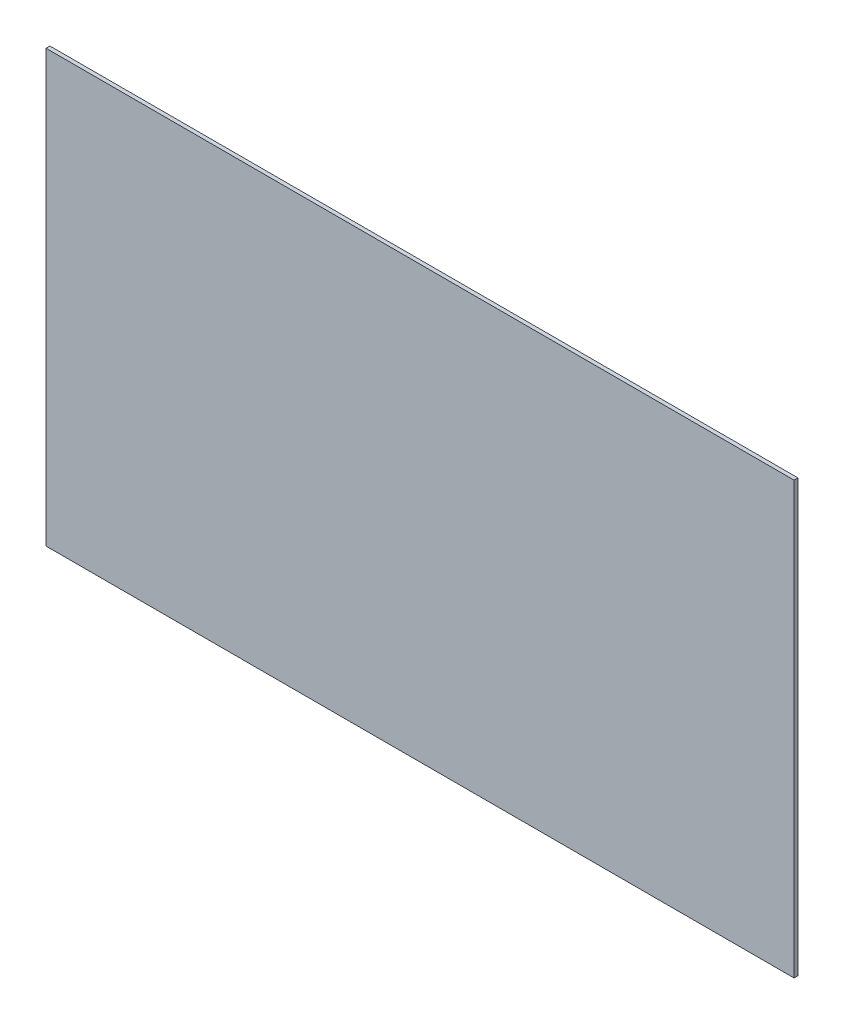
ISO-10303-21;
HEADER;
FILE_DESCRIPTION(('STEP AP214'),'2;1');
FILE_NAME('part.step','',(''),(''),'','','');
FILE_SCHEMA(('AUTOMOTIVE_DESIGN { 1 0 10303 214 1 1 1 1 }'));
ENDSEC;
DATA;
#1=APPLICATION_CONTEXT('core data for automotive mechanical design processes');
#2=APPLICATION_PROTOCOL_DEFINITION('international standard','automotive_design',2000,#1);
#3=PRODUCT_CONTEXT('',#1,'mechanical');
#4=PRODUCT('Part','Part','',(#3));
#5=PRODUCT_RELATED_PRODUCT_CATEGORY('part','',(#4));
#6=PRODUCT_DEFINITION_FORMATION('','',#4);
#7=PRODUCT_DEFINITION_CONTEXT('part definition',#1,'design');
#8=PRODUCT_DEFINITION('design','',#6,#7);
#9=PRODUCT_DEFINITION_SHAPE('','',#8);
#10=(LENGTH_UNIT() NAMED_UNIT(*) SI_UNIT(.MILLI.,.METRE.));
#11=(NAMED_UNIT(*) PLANE_ANGLE_UNIT() SI_UNIT($,.RADIAN.));
#12=(NAMED_UNIT(*) SI_UNIT($,.STERADIAN.) SOLID_ANGLE_UNIT());
#13=UNCERTAINTY_MEASURE_WITH_UNIT(LENGTH_MEASURE(1.E-05),#10,'distance_accuracy_value','');
#14=(GEOMETRIC_REPRESENTATION_CONTEXT(3) GLOBAL_UNCERTAINTY_ASSIGNED_CONTEXT((#13)) GLOBAL_UNIT_ASSIGNED_CONTEXT((#10,
#11,#12)) REPRESENTATION_CONTEXT('',''));
#15=CARTESIAN_POINT('',(0.,0.,0.));
#16=DIRECTION('',(0.,0.,1.));
#17=DIRECTION('',(1.,0.,0.));
#18=AXIS2_PLACEMENT_3D('',#15,#16,#17);
#19=CARTESIAN_POINT('',(0.,0.,9.525));
#20=DIRECTION('',(1.,0.,0.));
#21=DIRECTION('',(0.,0.,-1.));
#22=AXIS2_PLACEMENT_3D('',#19,#20,#21);
#23=PLANE('',#22);
#24=DIRECTION('',(0.,-1.,0.));
#25=VECTOR('',#24,1.);
#26=CARTESIAN_POINT('',(0.,0.,0.));
#27=LINE('',#26,#25);
#28=CARTESIAN_POINT('',(0.,1054.1,0.));
#29=VERTEX_POINT('',#28);
#30=CARTESIAN_POINT('',(0.,0.,0.));
#31=VERTEX_POINT('',#30);
#32=EDGE_CURVE('E100',#29,#31,#27,.T.);
#33=ORIENTED_EDGE('',*,*,#32,.T.);
#34=DIRECTION('',(0.,0.,-1.));
#35=VECTOR('',#34,1.);
#36=CARTESIAN_POINT('',(0.,0.,9.525));
#37=LINE('',#36,#35);
#38=CARTESIAN_POINT('',(0.,0.,9.525));
#39=VERTEX_POINT('',#38);
#40=EDGE_CURVE('E11',#39,#31,#37,.T.);
#41=ORIENTED_EDGE('',*,*,#40,.F.);
#42=DIRECTION('',(0.,-1.,0.));
#43=VECTOR('',#42,1.);
#44=CARTESIAN_POINT('',(0.,0.,9.525));
#45=LINE('',#44,#43);
#46=CARTESIAN_POINT('',(0.,1054.1,9.525));
#47=VERTEX_POINT('',#46);
#48=EDGE_CURVE('E88',#47,#39,#45,.T.);
#49=ORIENTED_EDGE('',*,*,#48,.F.);
#50=DIRECTION('',(0.,0.,-1.));
#51=VECTOR('',#50,1.);
#52=CARTESIAN_POINT('',(0.,1054.1,9.525));
#53=LINE('',#52,#51);
#54=EDGE_CURVE('E96',#47,#29,#53,.T.);
#55=ORIENTED_EDGE('',*,*,#54,.T.);
#56=EDGE_LOOP('',(#33,#41,#49,#55));
#57=FACE_BOUND('',#56,.T.);
#58=ADVANCED_FACE('F37',(#57),#23,.F.);
#59=CARTESIAN_POINT('',(0.,0.,9.525));
#60=DIRECTION('',(0.,1.,0.));
#61=DIRECTION('',(0.,0.,1.));
#62=AXIS2_PLACEMENT_3D('',#59,#60,#61);
#63=PLANE('',#62);
#64=DIRECTION('',(1.,0.,0.));
#65=VECTOR('',#64,1.);
#66=CARTESIAN_POINT('',(0.,0.,0.));
#67=LINE('',#66,#65);
#68=CARTESIAN_POINT('',(1828.8,0.,0.));
#69=VERTEX_POINT('',#68);
#70=EDGE_CURVE('E92',#31,#69,#67,.T.);
#71=ORIENTED_EDGE('',*,*,#70,.T.);
#72=DIRECTION('',(0.,0.,-1.));
#73=VECTOR('',#72,1.);
#74=CARTESIAN_POINT('',(1828.8,0.,9.525));
#75=LINE('',#74,#73);
#76=CARTESIAN_POINT('',(1828.8,0.,9.525));
#77=VERTEX_POINT('',#76);
#78=EDGE_CURVE('E45',#77,#69,#75,.T.);
#79=ORIENTED_EDGE('',*,*,#78,.F.);
#80=DIRECTION('',(1.,0.,0.));
#81=VECTOR('',#80,1.);
#82=CARTESIAN_POINT('',(0.,0.,9.525));
#83=LINE('',#82,#81);
#84=EDGE_CURVE('E83',#39,#77,#83,.T.);
#85=ORIENTED_EDGE('',*,*,#84,.F.);
#86=ORIENTED_EDGE('',*,*,#40,.T.);
#87=EDGE_LOOP('',(#71,#79,#85,#86));
#88=FACE_BOUND('',#87,.T.);
#89=ADVANCED_FACE('F91',(#88),#63,.F.);
#90=CARTESIAN_POINT('',(1828.8,0.,9.525));
#91=DIRECTION('',(-1.,0.,0.));
#92=DIRECTION('',(0.,0.,1.));
#93=AXIS2_PLACEMENT_3D('',#90,#91,#92);
#94=PLANE('',#93);
#95=DIRECTION('',(0.,1.,0.));
#96=VECTOR('',#95,1.);
#97=CARTESIAN_POINT('',(1828.8,0.,0.));
#98=LINE('',#97,#96);
#99=CARTESIAN_POINT('',(1828.8,1054.1,0.));
#100=VERTEX_POINT('',#99);
#101=EDGE_CURVE('E70',#69,#100,#98,.T.);
#102=ORIENTED_EDGE('',*,*,#101,.T.);
#103=DIRECTION('',(0.,0.,-1.));
#104=VECTOR('',#103,1.);
#105=CARTESIAN_POINT('',(1828.8,1054.1,9.525));
#106=LINE('',#105,#104);
#107=CARTESIAN_POINT('',(1828.8,1054.1,9.525));
#108=VERTEX_POINT('',#107);
#109=EDGE_CURVE('E93',#108,#100,#106,.T.);
#110=ORIENTED_EDGE('',*,*,#109,.F.);
#111=DIRECTION('',(0.,1.,0.));
#112=VECTOR('',#111,1.);
#113=CARTESIAN_POINT('',(1828.8,0.,9.525));
#114=LINE('',#113,#112);
#115=EDGE_CURVE('E86',#77,#108,#114,.T.);
#116=ORIENTED_EDGE('',*,*,#115,.F.);
#117=ORIENTED_EDGE('',*,*,#78,.T.);
#118=EDGE_LOOP('',(#102,#110,#116,#117));
#119=FACE_BOUND('',#118,.T.);
#120=ADVANCED_FACE('F94',(#119),#94,.F.);
#121=CARTESIAN_POINT('',(0.,1054.1,9.525));
#122=DIRECTION('',(0.,-1.,0.));
#123=DIRECTION('',(0.,0.,-1.));
#124=AXIS2_PLACEMENT_3D('',#121,#122,#123);
#125=PLANE('',#124);
#126=DIRECTION('',(-1.,0.,0.));
#127=VECTOR('',#126,1.);
#128=CARTESIAN_POINT('',(0.,1054.1,0.));
#129=LINE('',#128,#127);
#130=EDGE_CURVE('E76',#100,#29,#129,.T.);
#131=ORIENTED_EDGE('',*,*,#130,.T.);
#132=ORIENTED_EDGE('',*,*,#54,.F.);
#133=DIRECTION('',(-1.,0.,0.));
#134=VECTOR('',#133,1.);
#135=CARTESIAN_POINT('',(0.,1054.1,9.525));
#136=LINE('',#135,#134);
#137=EDGE_CURVE('E53',#108,#47,#136,.T.);
#138=ORIENTED_EDGE('',*,*,#137,.F.);
#139=ORIENTED_EDGE('',*,*,#109,.T.);
#140=EDGE_LOOP('',(#131,#132,#138,#139));
#141=FACE_BOUND('',#140,.T.);
#142=ADVANCED_FACE('F107',(#141),#125,.F.);
#143=CARTESIAN_POINT('',(0.,0.,9.525));
#144=DIRECTION('',(0.,0.,-1.));
#145=DIRECTION('',(-1.,0.,0.));
#146=AXIS2_PLACEMENT_3D('',#143,#144,#145);
#147=PLANE('',#146);
#148=ORIENTED_EDGE('',*,*,#48,.T.);
#149=ORIENTED_EDGE('',*,*,#84,.T.);
#150=ORIENTED_EDGE('',*,*,#115,.T.);
#151=ORIENTED_EDGE('',*,*,#137,.T.);
#152=EDGE_LOOP('',(#148,#149,#150,#151));
#153=FACE_BOUND('',#152,.T.);
#154=ADVANCED_FACE('F84',(#153),#147,.F.);
#155=CARTESIAN_POINT('',(0.,0.,0.));
#156=DIRECTION('',(0.,0.,-1.));
#157=DIRECTION('',(-1.,0.,0.));
#158=AXIS2_PLACEMENT_3D('',#155,#156,#157);
#159=PLANE('',#158);
#160=ORIENTED_EDGE('',*,*,#32,.F.);
#161=ORIENTED_EDGE('',*,*,#130,.F.);
#162=ORIENTED_EDGE('',*,*,#101,.F.);
#163=ORIENTED_EDGE('',*,*,#70,.F.);
#164=EDGE_LOOP('',(#160,#161,#162,#163));
#165=FACE_BOUND('',#164,.T.);
#166=ADVANCED_FACE('F110',(#165),#159,.T.);
#167=CLOSED_SHELL('',(#58,#89,#120,#142,#154,#166));
#168=MANIFOLD_SOLID_BREP('B2',#167);
#169=ADVANCED_BREP_SHAPE_REPRESENTATION('',(#18,#168),#14);
#170=SHAPE_DEFINITION_REPRESENTATION(#9,#169);
ENDSEC;
END-ISO-10303-21;
